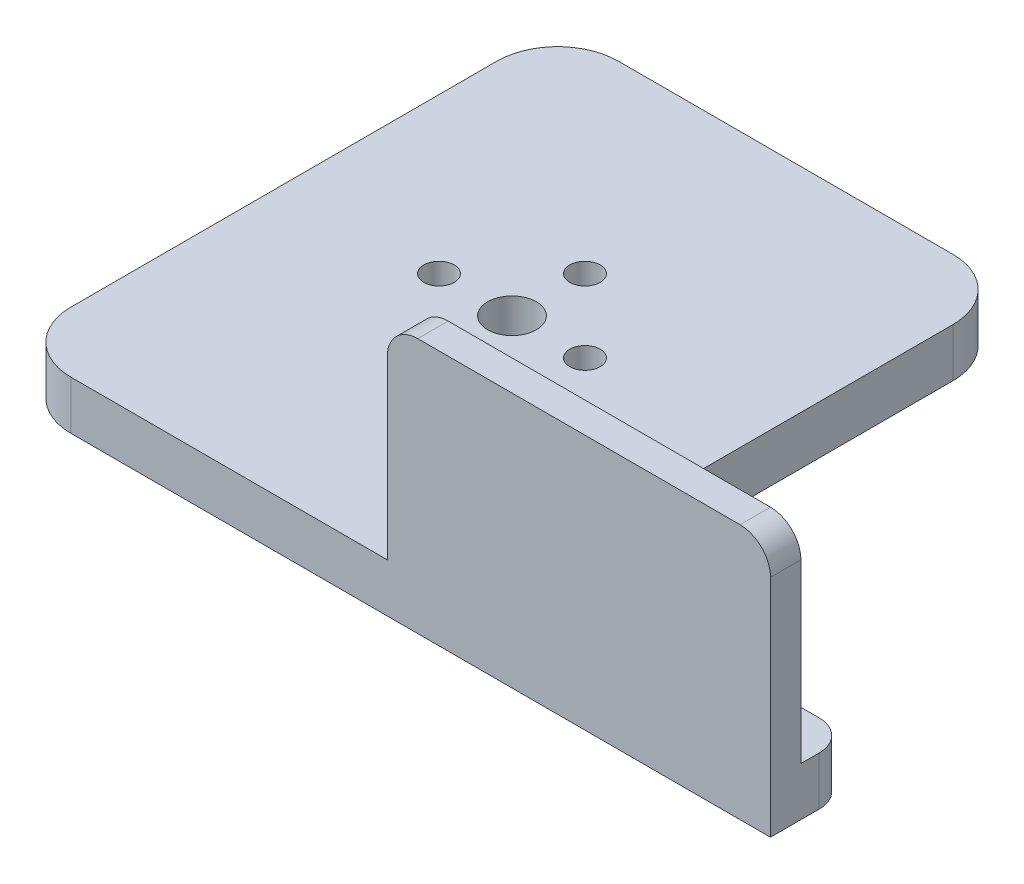
ISO-10303-21;
HEADER;
FILE_DESCRIPTION(('STEP AP214'),'2;1');
FILE_NAME('part.step','',(''),(''),'','','');
FILE_SCHEMA(('AUTOMOTIVE_DESIGN { 1 0 10303 214 1 1 1 1 }'));
ENDSEC;
DATA;
#1=APPLICATION_CONTEXT('core data for automotive mechanical design processes');
#2=APPLICATION_PROTOCOL_DEFINITION('international standard','automotive_design',2000,#1);
#3=PRODUCT_CONTEXT('',#1,'mechanical');
#4=PRODUCT('Part','Part','',(#3));
#5=PRODUCT_RELATED_PRODUCT_CATEGORY('part','',(#4));
#6=PRODUCT_DEFINITION_FORMATION('','',#4);
#7=PRODUCT_DEFINITION_CONTEXT('part definition',#1,'design');
#8=PRODUCT_DEFINITION('design','',#6,#7);
#9=PRODUCT_DEFINITION_SHAPE('','',#8);
#10=(LENGTH_UNIT() NAMED_UNIT(*) SI_UNIT(.MILLI.,.METRE.));
#11=(NAMED_UNIT(*) PLANE_ANGLE_UNIT() SI_UNIT($,.RADIAN.));
#12=(NAMED_UNIT(*) SI_UNIT($,.STERADIAN.) SOLID_ANGLE_UNIT());
#13=UNCERTAINTY_MEASURE_WITH_UNIT(LENGTH_MEASURE(1.E-05),#10,'distance_accuracy_value','');
#14=(GEOMETRIC_REPRESENTATION_CONTEXT(3) GLOBAL_UNCERTAINTY_ASSIGNED_CONTEXT((#13)) GLOBAL_UNIT_ASSIGNED_CONTEXT((#10,
#11,#12)) REPRESENTATION_CONTEXT('',''));
#15=CARTESIAN_POINT('',(0.,0.,0.));
#16=DIRECTION('',(0.,0.,1.));
#17=DIRECTION('',(1.,0.,0.));
#18=AXIS2_PLACEMENT_3D('',#15,#16,#17);
#19=CARTESIAN_POINT('',(67.,37.,90.));
#20=DIRECTION('',(0.,0.,1.));
#21=DIRECTION('',(1.,0.,0.));
#22=AXIS2_PLACEMENT_3D('',#19,#20,#21);
#23=CYLINDRICAL_SURFACE('',#22,5.);
#24=DIRECTION('',(0.,0.,1.));
#25=VECTOR('',#24,1.);
#26=CARTESIAN_POINT('',(67.,42.,90.));
#27=LINE('',#26,#25);
#28=CARTESIAN_POINT('',(67.,42.,85.));
#29=VERTEX_POINT('',#28);
#30=CARTESIAN_POINT('',(67.,42.,90.));
#31=VERTEX_POINT('',#30);
#32=EDGE_CURVE('E250',#29,#31,#27,.T.);
#33=ORIENTED_EDGE('',*,*,#32,.F.);
#34=CARTESIAN_POINT('',(67.,37.,85.));
#35=DIRECTION('',(0.,0.,-1.));
#36=DIRECTION('',(-1.,0.,0.));
#37=AXIS2_PLACEMENT_3D('',#34,#35,#36);
#38=CIRCLE('',#37,5.);
#39=CARTESIAN_POINT('',(62.,37.,85.));
#40=VERTEX_POINT('',#39);
#41=EDGE_CURVE('E48',#40,#29,#38,.T.);
#42=ORIENTED_EDGE('',*,*,#41,.F.);
#43=DIRECTION('',(0.,0.,1.));
#44=VECTOR('',#43,1.);
#45=CARTESIAN_POINT('',(62.,37.,0.));
#46=LINE('',#45,#44);
#47=CARTESIAN_POINT('',(62.,37.,90.));
#48=VERTEX_POINT('',#47);
#49=EDGE_CURVE('E253',#48,#40,#46,.F.);
#50=ORIENTED_EDGE('',*,*,#49,.F.);
#51=CARTESIAN_POINT('',(67.,37.,90.));
#52=DIRECTION('',(0.,0.,-1.));
#53=DIRECTION('',(-1.,0.,0.));
#54=AXIS2_PLACEMENT_3D('',#51,#52,#53);
#55=CIRCLE('',#54,5.);
#56=EDGE_CURVE('E11',#31,#48,#55,.F.);
#57=ORIENTED_EDGE('',*,*,#56,.F.);
#58=EDGE_LOOP('',(#33,#42,#50,#57));
#59=FACE_BOUND('',#58,.T.);
#60=ADVANCED_FACE('F41',(#59),#23,.T.);
#61=CARTESIAN_POINT('',(120.,8.,82.));
#62=DIRECTION('',(0.,-1.,0.));
#63=DIRECTION('',(0.,0.,-1.));
#64=AXIS2_PLACEMENT_3D('',#61,#62,#63);
#65=CYLINDRICAL_SURFACE('',#64,5.);
#66=DIRECTION('',(0.,1.,0.));
#67=VECTOR('',#66,1.);
#68=CARTESIAN_POINT('',(125.,8.,82.));
#69=LINE('',#68,#67);
#70=CARTESIAN_POINT('',(125.,0.,82.));
#71=VERTEX_POINT('',#70);
#72=CARTESIAN_POINT('',(125.,8.,82.));
#73=VERTEX_POINT('',#72);
#74=EDGE_CURVE('E240',#71,#73,#69,.T.);
#75=ORIENTED_EDGE('',*,*,#74,.F.);
#76=CARTESIAN_POINT('',(120.,0.,82.));
#77=DIRECTION('',(0.,1.,0.));
#78=DIRECTION('',(0.,0.,1.));
#79=AXIS2_PLACEMENT_3D('',#76,#77,#78);
#80=CIRCLE('',#79,5.);
#81=CARTESIAN_POINT('',(120.,0.,77.));
#82=VERTEX_POINT('',#81);
#83=EDGE_CURVE('E246',#82,#71,#80,.F.);
#84=ORIENTED_EDGE('',*,*,#83,.F.);
#85=DIRECTION('',(0.,1.,0.));
#86=VECTOR('',#85,1.);
#87=CARTESIAN_POINT('',(120.,8.,77.));
#88=LINE('',#87,#86);
#89=CARTESIAN_POINT('',(120.,8.,77.));
#90=VERTEX_POINT('',#89);
#91=EDGE_CURVE('E243',#90,#82,#88,.F.);
#92=ORIENTED_EDGE('',*,*,#91,.F.);
#93=CARTESIAN_POINT('',(120.,8.,82.));
#94=DIRECTION('',(0.,1.,0.));
#95=DIRECTION('',(0.,0.,1.));
#96=AXIS2_PLACEMENT_3D('',#93,#94,#95);
#97=CIRCLE('',#96,5.);
#98=EDGE_CURVE('E248',#73,#90,#97,.T.);
#99=ORIENTED_EDGE('',*,*,#98,.F.);
#100=EDGE_LOOP('',(#75,#84,#92,#99));
#101=FACE_BOUND('',#100,.T.);
#102=ADVANCED_FACE('F307',(#101),#65,.T.);
#103=CARTESIAN_POINT('',(120.,37.,0.));
#104=DIRECTION('',(0.,0.,-1.));
#105=DIRECTION('',(-1.,0.,0.));
#106=AXIS2_PLACEMENT_3D('',#103,#104,#105);
#107=CYLINDRICAL_SURFACE('',#106,5.);
#108=DIRECTION('',(0.,0.,1.));
#109=VECTOR('',#108,1.);
#110=CARTESIAN_POINT('',(125.,37.,0.));
#111=LINE('',#110,#109);
#112=CARTESIAN_POINT('',(125.,37.,85.));
#113=VERTEX_POINT('',#112);
#114=CARTESIAN_POINT('',(125.,37.,90.));
#115=VERTEX_POINT('',#114);
#116=EDGE_CURVE('E229',#113,#115,#111,.T.);
#117=ORIENTED_EDGE('',*,*,#116,.F.);
#118=CARTESIAN_POINT('',(120.,37.,85.));
#119=DIRECTION('',(0.,0.,-1.));
#120=DIRECTION('',(-1.,0.,0.));
#121=AXIS2_PLACEMENT_3D('',#118,#119,#120);
#122=CIRCLE('',#121,5.);
#123=CARTESIAN_POINT('',(120.,42.,85.));
#124=VERTEX_POINT('',#123);
#125=EDGE_CURVE('E235',#124,#113,#122,.T.);
#126=ORIENTED_EDGE('',*,*,#125,.F.);
#127=DIRECTION('',(0.,0.,1.));
#128=VECTOR('',#127,1.);
#129=CARTESIAN_POINT('',(120.,42.,0.));
#130=LINE('',#129,#128);
#131=CARTESIAN_POINT('',(120.,42.,90.));
#132=VERTEX_POINT('',#131);
#133=EDGE_CURVE('E232',#132,#124,#130,.F.);
#134=ORIENTED_EDGE('',*,*,#133,.F.);
#135=CARTESIAN_POINT('',(120.,37.,90.));
#136=DIRECTION('',(0.,0.,-1.));
#137=DIRECTION('',(-1.,0.,0.));
#138=AXIS2_PLACEMENT_3D('',#135,#136,#137);
#139=CIRCLE('',#138,5.);
#140=EDGE_CURVE('E237',#115,#132,#139,.F.);
#141=ORIENTED_EDGE('',*,*,#140,.F.);
#142=EDGE_LOOP('',(#117,#126,#134,#141));
#143=FACE_BOUND('',#142,.T.);
#144=ADVANCED_FACE('F303',(#143),#107,.T.);
#145=CARTESIAN_POINT('',(0.,8.,0.));
#146=DIRECTION('',(0.,1.,0.));
#147=DIRECTION('',(0.,0.,1.));
#148=AXIS2_PLACEMENT_3D('',#145,#146,#147);
#149=PLANE('',#148);
#150=CARTESIAN_POINT('',(37.5,8.,57.));
#151=DIRECTION('',(0.,1.,0.));
#152=DIRECTION('',(0.,0.,1.));
#153=AXIS2_PLACEMENT_3D('',#150,#151,#152);
#154=CIRCLE('',#153,2.5);
#155=CARTESIAN_POINT('',(37.5,8.,59.5));
#156=VERTEX_POINT('',#155);
#157=EDGE_CURVE('E548',#156,#156,#154,.F.);
#158=ORIENTED_EDGE('',*,*,#157,.T.);
#159=EDGE_LOOP('',(#158));
#160=FACE_BOUND('',#159,.T.);
#161=CARTESIAN_POINT('',(25.5000000000002,8.,45.));
#162=DIRECTION('',(0.,1.,0.));
#163=DIRECTION('',(0.,0.,1.));
#164=AXIS2_PLACEMENT_3D('',#161,#162,#163);
#165=CIRCLE('',#164,2.5);
#166=CARTESIAN_POINT('',(25.5000000000002,8.,47.5));
#167=VERTEX_POINT('',#166);
#168=EDGE_CURVE('E565',#167,#167,#165,.F.);
#169=ORIENTED_EDGE('',*,*,#168,.T.);
#170=EDGE_LOOP('',(#169));
#171=FACE_BOUND('',#170,.T.);
#172=CARTESIAN_POINT('',(37.5000000000003,8.,33.));
#173=DIRECTION('',(0.,1.,0.));
#174=DIRECTION('',(0.,0.,1.));
#175=AXIS2_PLACEMENT_3D('',#172,#173,#174);
#176=CIRCLE('',#175,2.50000000000001);
#177=CARTESIAN_POINT('',(37.5000000000003,8.,35.5));
#178=VERTEX_POINT('',#177);
#179=EDGE_CURVE('E571',#178,#178,#176,.F.);
#180=ORIENTED_EDGE('',*,*,#179,.T.);
#181=EDGE_LOOP('',(#180));
#182=FACE_BOUND('',#181,.T.);
#183=CARTESIAN_POINT('',(37.5,8.,45.));
#184=DIRECTION('',(0.,1.,0.));
#185=DIRECTION('',(0.,0.,1.));
#186=AXIS2_PLACEMENT_3D('',#183,#184,#185);
#187=CIRCLE('',#186,4.);
#188=CARTESIAN_POINT('',(37.5,8.,49.));
#189=VERTEX_POINT('',#188);
#190=EDGE_CURVE('E552',#189,#189,#187,.F.);
#191=ORIENTED_EDGE('',*,*,#190,.T.);
#192=EDGE_LOOP('',(#191));
#193=FACE_BOUND('',#192,.T.);
#194=CARTESIAN_POINT('',(49.5000000000002,8.,45.0000000000001));
#195=DIRECTION('',(0.,1.,0.));
#196=DIRECTION('',(0.,0.,1.));
#197=AXIS2_PLACEMENT_3D('',#194,#195,#196);
#198=CIRCLE('',#197,2.5);
#199=CARTESIAN_POINT('',(49.5000000000002,8.,47.5000000000001));
#200=VERTEX_POINT('',#199);
#201=EDGE_CURVE('E559',#200,#200,#198,.F.);
#202=ORIENTED_EDGE('',*,*,#201,.T.);
#203=EDGE_LOOP('',(#202));
#204=FACE_BOUND('',#203,.T.);
#205=DIRECTION('',(0.,0.,-1.));
#206=VECTOR('',#205,1.);
#207=CARTESIAN_POINT('',(125.,8.,0.));
#208=LINE('',#207,#206);
#209=CARTESIAN_POINT('',(125.,8.,85.));
#210=VERTEX_POINT('',#209);
#211=EDGE_CURVE('E166',#210,#73,#208,.T.);
#212=ORIENTED_EDGE('',*,*,#211,.T.);
#213=ORIENTED_EDGE('',*,*,#98,.T.);
#214=DIRECTION('',(1.,0.,0.));
#215=VECTOR('',#214,1.);
#216=CARTESIAN_POINT('',(0.,8.,77.));
#217=LINE('',#216,#215);
#218=CARTESIAN_POINT('',(75.,8.,77.));
#219=VERTEX_POINT('',#218);
#220=EDGE_CURVE('E169',#219,#90,#217,.T.);
#221=ORIENTED_EDGE('',*,*,#220,.F.);
#222=DIRECTION('',(0.,0.,1.));
#223=VECTOR('',#222,1.);
#224=CARTESIAN_POINT('',(75.,8.,0.));
#225=LINE('',#224,#223);
#226=CARTESIAN_POINT('',(75.,8.,10.));
#227=VERTEX_POINT('',#226);
#228=EDGE_CURVE('E196',#227,#219,#225,.T.);
#229=ORIENTED_EDGE('',*,*,#228,.F.);
#230=CARTESIAN_POINT('',(65.,8.,10.));
#231=DIRECTION('',(0.,1.,0.));
#232=DIRECTION('',(0.,0.,1.));
#233=AXIS2_PLACEMENT_3D('',#230,#231,#232);
#234=CIRCLE('',#233,10.);
#235=CARTESIAN_POINT('',(65.,8.,0.));
#236=VERTEX_POINT('',#235);
#237=EDGE_CURVE('E225',#227,#236,#234,.T.);
#238=ORIENTED_EDGE('',*,*,#237,.T.);
#239=DIRECTION('',(1.,0.,0.));
#240=VECTOR('',#239,1.);
#241=CARTESIAN_POINT('',(0.,8.,0.));
#242=LINE('',#241,#240);
#243=CARTESIAN_POINT('',(10.,8.,0.));
#244=VERTEX_POINT('',#243);
#245=EDGE_CURVE('E171',#244,#236,#242,.T.);
#246=ORIENTED_EDGE('',*,*,#245,.F.);
#247=CARTESIAN_POINT('',(10.,8.,10.));
#248=DIRECTION('',(0.,1.,0.));
#249=DIRECTION('',(0.,0.,1.));
#250=AXIS2_PLACEMENT_3D('',#247,#248,#249);
#251=CIRCLE('',#250,10.);
#252=CARTESIAN_POINT('',(0.,8.,10.));
#253=VERTEX_POINT('',#252);
#254=EDGE_CURVE('E209',#244,#253,#251,.T.);
#255=ORIENTED_EDGE('',*,*,#254,.T.);
#256=DIRECTION('',(0.,0.,1.));
#257=VECTOR('',#256,1.);
#258=CARTESIAN_POINT('',(0.,8.,0.));
#259=LINE('',#258,#257);
#260=CARTESIAN_POINT('',(0.,8.,80.));
#261=VERTEX_POINT('',#260);
#262=EDGE_CURVE('E167',#253,#261,#259,.T.);
#263=ORIENTED_EDGE('',*,*,#262,.T.);
#264=CARTESIAN_POINT('',(10.,8.,80.));
#265=DIRECTION('',(0.,1.,0.));
#266=DIRECTION('',(0.,0.,1.));
#267=AXIS2_PLACEMENT_3D('',#264,#265,#266);
#268=CIRCLE('',#267,10.);
#269=CARTESIAN_POINT('',(10.,8.,90.));
#270=VERTEX_POINT('',#269);
#271=EDGE_CURVE('E164',#261,#270,#268,.T.);
#272=ORIENTED_EDGE('',*,*,#271,.T.);
#273=DIRECTION('',(1.,0.,0.));
#274=VECTOR('',#273,1.);
#275=CARTESIAN_POINT('',(0.,8.,90.));
#276=LINE('',#275,#274);
#277=CARTESIAN_POINT('',(62.,8.,90.));
#278=VERTEX_POINT('',#277);
#279=EDGE_CURVE('E148',#270,#278,#276,.T.);
#280=ORIENTED_EDGE('',*,*,#279,.T.);
#281=DIRECTION('',(0.,0.,-1.));
#282=VECTOR('',#281,1.);
#283=CARTESIAN_POINT('',(62.,8.,90.));
#284=LINE('',#283,#282);
#285=CARTESIAN_POINT('',(62.,8.,85.));
#286=VERTEX_POINT('',#285);
#287=EDGE_CURVE('E150',#278,#286,#284,.T.);
#288=ORIENTED_EDGE('',*,*,#287,.T.);
#289=DIRECTION('',(1.,0.,0.));
#290=VECTOR('',#289,1.);
#291=CARTESIAN_POINT('',(62.,8.,85.));
#292=LINE('',#291,#290);
#293=EDGE_CURVE('E262',#286,#210,#292,.T.);
#294=ORIENTED_EDGE('',*,*,#293,.T.);
#295=EDGE_LOOP('',(#212,#213,#221,#229,#238,#246,#255,#263,#272,#280,#288,#294));
#296=FACE_BOUND('',#295,.T.);
#297=ADVANCED_FACE('F162',(#160,#171,#182,#193,#204,#296),#149,.T.);
#298=CARTESIAN_POINT('',(65.,8.,10.));
#299=DIRECTION('',(0.,-1.,0.));
#300=DIRECTION('',(0.,0.,-1.));
#301=AXIS2_PLACEMENT_3D('',#298,#299,#300);
#302=CYLINDRICAL_SURFACE('',#301,10.);
#303=DIRECTION('',(0.,-1.,0.));
#304=VECTOR('',#303,1.);
#305=CARTESIAN_POINT('',(65.,8.,0.));
#306=LINE('',#305,#304);
#307=CARTESIAN_POINT('',(65.,0.,0.));
#308=VERTEX_POINT('',#307);
#309=EDGE_CURVE('E219',#236,#308,#306,.T.);
#310=ORIENTED_EDGE('',*,*,#309,.F.);
#311=ORIENTED_EDGE('',*,*,#237,.F.);
#312=DIRECTION('',(0.,-1.,0.));
#313=VECTOR('',#312,1.);
#314=CARTESIAN_POINT('',(75.,8.,10.));
#315=LINE('',#314,#313);
#316=CARTESIAN_POINT('',(75.,0.,10.));
#317=VERTEX_POINT('',#316);
#318=EDGE_CURVE('E222',#317,#227,#315,.F.);
#319=ORIENTED_EDGE('',*,*,#318,.F.);
#320=CARTESIAN_POINT('',(65.,0.,10.));
#321=DIRECTION('',(0.,1.,0.));
#322=DIRECTION('',(0.,0.,1.));
#323=AXIS2_PLACEMENT_3D('',#320,#321,#322);
#324=CIRCLE('',#323,10.);
#325=EDGE_CURVE('E227',#308,#317,#324,.F.);
#326=ORIENTED_EDGE('',*,*,#325,.F.);
#327=EDGE_LOOP('',(#310,#311,#319,#326));
#328=FACE_BOUND('',#327,.T.);
#329=ADVANCED_FACE('F280',(#328),#302,.T.);
#330=CARTESIAN_POINT('',(10.,8.,80.));
#331=DIRECTION('',(0.,-1.,0.));
#332=DIRECTION('',(0.,0.,-1.));
#333=AXIS2_PLACEMENT_3D('',#330,#331,#332);
#334=CYLINDRICAL_SURFACE('',#333,10.);
#335=DIRECTION('',(0.,-1.,0.));
#336=VECTOR('',#335,1.);
#337=CARTESIAN_POINT('',(10.,8.,90.));
#338=LINE('',#337,#336);
#339=CARTESIAN_POINT('',(10.,0.,90.));
#340=VERTEX_POINT('',#339);
#341=EDGE_CURVE('E211',#270,#340,#338,.T.);
#342=ORIENTED_EDGE('',*,*,#341,.F.);
#343=ORIENTED_EDGE('',*,*,#271,.F.);
#344=DIRECTION('',(0.,-1.,0.));
#345=VECTOR('',#344,1.);
#346=CARTESIAN_POINT('',(0.,8.,80.));
#347=LINE('',#346,#345);
#348=CARTESIAN_POINT('',(0.,0.,80.));
#349=VERTEX_POINT('',#348);
#350=EDGE_CURVE('E213',#349,#261,#347,.F.);
#351=ORIENTED_EDGE('',*,*,#350,.F.);
#352=CARTESIAN_POINT('',(10.,0.,80.));
#353=DIRECTION('',(0.,1.,0.));
#354=DIRECTION('',(0.,0.,1.));
#355=AXIS2_PLACEMENT_3D('',#352,#353,#354);
#356=CIRCLE('',#355,10.);
#357=EDGE_CURVE('E217',#340,#349,#356,.F.);
#358=ORIENTED_EDGE('',*,*,#357,.F.);
#359=EDGE_LOOP('',(#342,#343,#351,#358));
#360=FACE_BOUND('',#359,.T.);
#361=ADVANCED_FACE('F292',(#360),#334,.T.);
#362=CARTESIAN_POINT('',(10.,8.,10.));
#363=DIRECTION('',(0.,-1.,0.));
#364=DIRECTION('',(0.,0.,-1.));
#365=AXIS2_PLACEMENT_3D('',#362,#363,#364);
#366=CYLINDRICAL_SURFACE('',#365,10.);
#367=DIRECTION('',(0.,1.,0.));
#368=VECTOR('',#367,1.);
#369=CARTESIAN_POINT('',(10.,8.,0.));
#370=LINE('',#369,#368);
#371=CARTESIAN_POINT('',(10.,0.,0.));
#372=VERTEX_POINT('',#371);
#373=EDGE_CURVE('E201',#372,#244,#370,.T.);
#374=ORIENTED_EDGE('',*,*,#373,.F.);
#375=CARTESIAN_POINT('',(10.,0.,10.));
#376=DIRECTION('',(0.,1.,0.));
#377=DIRECTION('',(0.,0.,1.));
#378=AXIS2_PLACEMENT_3D('',#375,#376,#377);
#379=CIRCLE('',#378,10.);
#380=CARTESIAN_POINT('',(0.,0.,10.));
#381=VERTEX_POINT('',#380);
#382=EDGE_CURVE('E207',#381,#372,#379,.F.);
#383=ORIENTED_EDGE('',*,*,#382,.F.);
#384=DIRECTION('',(0.,1.,0.));
#385=VECTOR('',#384,1.);
#386=CARTESIAN_POINT('',(0.,8.,10.));
#387=LINE('',#386,#385);
#388=EDGE_CURVE('E204',#253,#381,#387,.F.);
#389=ORIENTED_EDGE('',*,*,#388,.F.);
#390=ORIENTED_EDGE('',*,*,#254,.F.);
#391=EDGE_LOOP('',(#374,#383,#389,#390));
#392=FACE_BOUND('',#391,.T.);
#393=ADVANCED_FACE('F286',(#392),#366,.T.);
#394=CARTESIAN_POINT('',(75.,8.,0.));
#395=DIRECTION('',(1.,0.,0.));
#396=DIRECTION('',(0.,0.,-1.));
#397=AXIS2_PLACEMENT_3D('',#394,#395,#396);
#398=PLANE('',#397);
#399=DIRECTION('',(0.,0.,1.));
#400=VECTOR('',#399,1.);
#401=CARTESIAN_POINT('',(75.,0.,0.));
#402=LINE('',#401,#400);
#403=CARTESIAN_POINT('',(75.,0.,77.));
#404=VERTEX_POINT('',#403);
#405=EDGE_CURVE('E178',#317,#404,#402,.T.);
#406=ORIENTED_EDGE('',*,*,#405,.F.);
#407=ORIENTED_EDGE('',*,*,#318,.T.);
#408=ORIENTED_EDGE('',*,*,#228,.T.);
#409=DIRECTION('',(0.,-1.,0.));
#410=VECTOR('',#409,1.);
#411=CARTESIAN_POINT('',(75.,8.,77.));
#412=LINE('',#411,#410);
#413=EDGE_CURVE('E177',#219,#404,#412,.T.);
#414=ORIENTED_EDGE('',*,*,#413,.T.);
#415=EDGE_LOOP('',(#406,#407,#408,#414));
#416=FACE_BOUND('',#415,.T.);
#417=ADVANCED_FACE('F313',(#416),#398,.T.);
#418=CARTESIAN_POINT('',(0.,8.,0.));
#419=DIRECTION('',(0.,0.,-1.));
#420=DIRECTION('',(-1.,0.,0.));
#421=AXIS2_PLACEMENT_3D('',#418,#419,#420);
#422=PLANE('',#421);
#423=ORIENTED_EDGE('',*,*,#245,.T.);
#424=ORIENTED_EDGE('',*,*,#309,.T.);
#425=DIRECTION('',(1.,0.,0.));
#426=VECTOR('',#425,1.);
#427=CARTESIAN_POINT('',(0.,0.,0.));
#428=LINE('',#427,#426);
#429=EDGE_CURVE('E180',#372,#308,#428,.T.);
#430=ORIENTED_EDGE('',*,*,#429,.F.);
#431=ORIENTED_EDGE('',*,*,#373,.T.);
#432=EDGE_LOOP('',(#423,#424,#430,#431));
#433=FACE_BOUND('',#432,.T.);
#434=ADVANCED_FACE('F271',(#433),#422,.T.);
#435=CARTESIAN_POINT('',(0.,8.,0.));
#436=DIRECTION('',(1.,0.,0.));
#437=DIRECTION('',(0.,0.,-1.));
#438=AXIS2_PLACEMENT_3D('',#435,#436,#437);
#439=PLANE('',#438);
#440=DIRECTION('',(0.,0.,1.));
#441=VECTOR('',#440,1.);
#442=CARTESIAN_POINT('',(0.,0.,0.));
#443=LINE('',#442,#441);
#444=EDGE_CURVE('E184',#381,#349,#443,.T.);
#445=ORIENTED_EDGE('',*,*,#444,.T.);
#446=ORIENTED_EDGE('',*,*,#350,.T.);
#447=ORIENTED_EDGE('',*,*,#262,.F.);
#448=ORIENTED_EDGE('',*,*,#388,.T.);
#449=EDGE_LOOP('',(#445,#446,#447,#448));
#450=FACE_BOUND('',#449,.T.);
#451=ADVANCED_FACE('F289',(#450),#439,.F.);
#452=CARTESIAN_POINT('',(0.,8.,90.));
#453=DIRECTION('',(0.,0.,-1.));
#454=DIRECTION('',(-1.,0.,0.));
#455=AXIS2_PLACEMENT_3D('',#452,#453,#454);
#456=PLANE('',#455);
#457=DIRECTION('',(1.,0.,0.));
#458=VECTOR('',#457,1.);
#459=CARTESIAN_POINT('',(62.,42.,90.));
#460=LINE('',#459,#458);
#461=EDGE_CURVE('E181',#31,#132,#460,.T.);
#462=ORIENTED_EDGE('',*,*,#461,.F.);
#463=ORIENTED_EDGE('',*,*,#56,.T.);
#464=DIRECTION('',(0.,-1.,0.));
#465=VECTOR('',#464,1.);
#466=CARTESIAN_POINT('',(62.,8.,90.));
#467=LINE('',#466,#465);
#468=EDGE_CURVE('E143',#48,#278,#467,.T.);
#469=ORIENTED_EDGE('',*,*,#468,.T.);
#470=ORIENTED_EDGE('',*,*,#279,.F.);
#471=ORIENTED_EDGE('',*,*,#341,.T.);
#472=DIRECTION('',(1.,0.,0.));
#473=VECTOR('',#472,1.);
#474=CARTESIAN_POINT('',(0.,0.,90.));
#475=LINE('',#474,#473);
#476=CARTESIAN_POINT('',(125.,0.,90.));
#477=VERTEX_POINT('',#476);
#478=EDGE_CURVE('E187',#340,#477,#475,.T.);
#479=ORIENTED_EDGE('',*,*,#478,.T.);
#480=DIRECTION('',(0.,-1.,0.));
#481=VECTOR('',#480,1.);
#482=CARTESIAN_POINT('',(125.,8.,90.));
#483=LINE('',#482,#481);
#484=EDGE_CURVE('E199',#115,#477,#483,.T.);
#485=ORIENTED_EDGE('',*,*,#484,.F.);
#486=ORIENTED_EDGE('',*,*,#140,.T.);
#487=EDGE_LOOP('',(#462,#463,#469,#470,#471,#479,#485,#486));
#488=FACE_BOUND('',#487,.T.);
#489=ADVANCED_FACE('F145',(#488),#456,.F.);
#490=CARTESIAN_POINT('',(125.,8.,0.));
#491=DIRECTION('',(-1.,0.,0.));
#492=DIRECTION('',(0.,0.,1.));
#493=AXIS2_PLACEMENT_3D('',#490,#491,#492);
#494=PLANE('',#493);
#495=DIRECTION('',(0.,0.,-1.));
#496=VECTOR('',#495,1.);
#497=CARTESIAN_POINT('',(125.,0.,0.));
#498=LINE('',#497,#496);
#499=EDGE_CURVE('E190',#477,#71,#498,.T.);
#500=ORIENTED_EDGE('',*,*,#499,.T.);
#501=ORIENTED_EDGE('',*,*,#74,.T.);
#502=ORIENTED_EDGE('',*,*,#211,.F.);
#503=DIRECTION('',(0.,1.,0.));
#504=VECTOR('',#503,1.);
#505=CARTESIAN_POINT('',(125.,8.,85.));
#506=LINE('',#505,#504);
#507=EDGE_CURVE('E151',#210,#113,#506,.T.);
#508=ORIENTED_EDGE('',*,*,#507,.T.);
#509=ORIENTED_EDGE('',*,*,#116,.T.);
#510=ORIENTED_EDGE('',*,*,#484,.T.);
#511=EDGE_LOOP('',(#500,#501,#502,#508,#509,#510));
#512=FACE_BOUND('',#511,.T.);
#513=ADVANCED_FACE('F298',(#512),#494,.F.);
#514=CARTESIAN_POINT('',(0.,8.,77.));
#515=DIRECTION('',(0.,0.,-1.));
#516=DIRECTION('',(-1.,0.,0.));
#517=AXIS2_PLACEMENT_3D('',#514,#515,#516);
#518=PLANE('',#517);
#519=ORIENTED_EDGE('',*,*,#220,.T.);
#520=ORIENTED_EDGE('',*,*,#91,.T.);
#521=DIRECTION('',(1.,0.,0.));
#522=VECTOR('',#521,1.);
#523=CARTESIAN_POINT('',(0.,0.,77.));
#524=LINE('',#523,#522);
#525=EDGE_CURVE('E193',#404,#82,#524,.T.);
#526=ORIENTED_EDGE('',*,*,#525,.F.);
#527=ORIENTED_EDGE('',*,*,#413,.F.);
#528=EDGE_LOOP('',(#519,#520,#526,#527));
#529=FACE_BOUND('',#528,.T.);
#530=ADVANCED_FACE('F311',(#529),#518,.T.);
#531=CARTESIAN_POINT('',(0.,0.,0.));
#532=DIRECTION('',(0.,1.,0.));
#533=DIRECTION('',(0.,0.,1.));
#534=AXIS2_PLACEMENT_3D('',#531,#532,#533);
#535=PLANE('',#534);
#536=CARTESIAN_POINT('',(37.5,0.,45.));
#537=DIRECTION('',(0.,-1.,0.));
#538=DIRECTION('',(0.,0.,-1.));
#539=AXIS2_PLACEMENT_3D('',#536,#537,#538);
#540=CIRCLE('',#539,16.);
#541=CARTESIAN_POINT('',(37.5,0.,29.));
#542=VERTEX_POINT('',#541);
#543=EDGE_CURVE('E541',#542,#542,#540,.T.);
#544=ORIENTED_EDGE('',*,*,#543,.F.);
#545=EDGE_LOOP('',(#544));
#546=FACE_BOUND('',#545,.T.);
#547=ORIENTED_EDGE('',*,*,#525,.T.);
#548=ORIENTED_EDGE('',*,*,#83,.T.);
#549=ORIENTED_EDGE('',*,*,#499,.F.);
#550=ORIENTED_EDGE('',*,*,#478,.F.);
#551=ORIENTED_EDGE('',*,*,#357,.T.);
#552=ORIENTED_EDGE('',*,*,#444,.F.);
#553=ORIENTED_EDGE('',*,*,#382,.T.);
#554=ORIENTED_EDGE('',*,*,#429,.T.);
#555=ORIENTED_EDGE('',*,*,#325,.T.);
#556=ORIENTED_EDGE('',*,*,#405,.T.);
#557=EDGE_LOOP('',(#547,#548,#549,#550,#551,#552,#553,#554,#555,#556));
#558=FACE_BOUND('',#557,.T.);
#559=ADVANCED_FACE('F283',(#546,#558),#535,.F.);
#560=CARTESIAN_POINT('',(62.,42.,90.));
#561=DIRECTION('',(0.,1.,0.));
#562=DIRECTION('',(0.,0.,1.));
#563=AXIS2_PLACEMENT_3D('',#560,#561,#562);
#564=PLANE('',#563);
#565=DIRECTION('',(1.,0.,0.));
#566=VECTOR('',#565,1.);
#567=CARTESIAN_POINT('',(62.,42.,85.));
#568=LINE('',#567,#566);
#569=EDGE_CURVE('E257',#29,#124,#568,.T.);
#570=ORIENTED_EDGE('',*,*,#569,.F.);
#571=ORIENTED_EDGE('',*,*,#32,.T.);
#572=ORIENTED_EDGE('',*,*,#461,.T.);
#573=ORIENTED_EDGE('',*,*,#133,.T.);
#574=EDGE_LOOP('',(#570,#571,#572,#573));
#575=FACE_BOUND('',#574,.T.);
#576=ADVANCED_FACE('F260',(#575),#564,.T.);
#577=CARTESIAN_POINT('',(62.,8.,85.));
#578=DIRECTION('',(0.,0.,-1.));
#579=DIRECTION('',(-1.,0.,0.));
#580=AXIS2_PLACEMENT_3D('',#577,#578,#579);
#581=PLANE('',#580);
#582=DIRECTION('',(0.,1.,0.));
#583=VECTOR('',#582,1.);
#584=CARTESIAN_POINT('',(62.,8.,85.));
#585=LINE('',#584,#583);
#586=EDGE_CURVE('E157',#286,#40,#585,.T.);
#587=ORIENTED_EDGE('',*,*,#586,.T.);
#588=ORIENTED_EDGE('',*,*,#41,.T.);
#589=ORIENTED_EDGE('',*,*,#569,.T.);
#590=ORIENTED_EDGE('',*,*,#125,.T.);
#591=ORIENTED_EDGE('',*,*,#507,.F.);
#592=ORIENTED_EDGE('',*,*,#293,.F.);
#593=EDGE_LOOP('',(#587,#588,#589,#590,#591,#592));
#594=FACE_BOUND('',#593,.T.);
#595=ADVANCED_FACE('F255',(#594),#581,.T.);
#596=CARTESIAN_POINT('',(62.,0.,0.));
#597=DIRECTION('',(-1.,0.,0.));
#598=DIRECTION('',(0.,0.,1.));
#599=AXIS2_PLACEMENT_3D('',#596,#597,#598);
#600=PLANE('',#599);
#601=ORIENTED_EDGE('',*,*,#468,.F.);
#602=ORIENTED_EDGE('',*,*,#49,.T.);
#603=ORIENTED_EDGE('',*,*,#586,.F.);
#604=ORIENTED_EDGE('',*,*,#287,.F.);
#605=EDGE_LOOP('',(#601,#602,#603,#604));
#606=FACE_BOUND('',#605,.T.);
#607=ADVANCED_FACE('F155',(#606),#600,.T.);
#608=CARTESIAN_POINT('',(37.5,1.,45.));
#609=DIRECTION('',(0.,-1.,0.));
#610=DIRECTION('',(0.,0.,-1.));
#611=AXIS2_PLACEMENT_3D('',#608,#609,#610);
#612=CYLINDRICAL_SURFACE('',#611,16.);
#613=CARTESIAN_POINT('',(37.5,1.,45.));
#614=DIRECTION('',(0.,-1.,0.));
#615=DIRECTION('',(0.,0.,-1.));
#616=AXIS2_PLACEMENT_3D('',#613,#614,#615);
#617=CIRCLE('',#616,16.);
#618=CARTESIAN_POINT('',(37.5,1.,29.));
#619=VERTEX_POINT('',#618);
#620=EDGE_CURVE('E304',#619,#619,#617,.T.);
#621=ORIENTED_EDGE('',*,*,#620,.F.);
#622=EDGE_LOOP('',(#621));
#623=FACE_BOUND('',#622,.T.);
#624=ORIENTED_EDGE('',*,*,#543,.T.);
#625=EDGE_LOOP('',(#624));
#626=FACE_BOUND('',#625,.T.);
#627=ADVANCED_FACE('F410',(#623,#626),#612,.F.);
#628=CARTESIAN_POINT('',(37.5,1.,45.));
#629=DIRECTION('',(0.,-1.,0.));
#630=DIRECTION('',(0.,0.,-1.));
#631=AXIS2_PLACEMENT_3D('',#628,#629,#630);
#632=PLANE('',#631);
#633=CARTESIAN_POINT('',(37.5,1.,45.));
#634=DIRECTION('',(0.,-1.,0.));
#635=DIRECTION('',(0.,0.,-1.));
#636=AXIS2_PLACEMENT_3D('',#633,#634,#635);
#637=CIRCLE('',#636,4.);
#638=CARTESIAN_POINT('',(37.5,1.,41.));
#639=VERTEX_POINT('',#638);
#640=EDGE_CURVE('E555',#639,#639,#637,.T.);
#641=ORIENTED_EDGE('',*,*,#640,.F.);
#642=EDGE_LOOP('',(#641));
#643=FACE_BOUND('',#642,.T.);
#644=CARTESIAN_POINT('',(37.5,1.,57.));
#645=DIRECTION('',(0.,-1.,0.));
#646=DIRECTION('',(0.,0.,-1.));
#647=AXIS2_PLACEMENT_3D('',#644,#645,#646);
#648=CIRCLE('',#647,2.5);
#649=CARTESIAN_POINT('',(37.5,1.,54.5));
#650=VERTEX_POINT('',#649);
#651=EDGE_CURVE('E543',#650,#650,#648,.T.);
#652=ORIENTED_EDGE('',*,*,#651,.F.);
#653=EDGE_LOOP('',(#652));
#654=FACE_BOUND('',#653,.T.);
#655=CARTESIAN_POINT('',(25.5000000000002,1.,45.));
#656=DIRECTION('',(0.,-1.,0.));
#657=DIRECTION('',(0.,0.,-1.));
#658=AXIS2_PLACEMENT_3D('',#655,#656,#657);
#659=CIRCLE('',#658,2.5);
#660=CARTESIAN_POINT('',(25.5000000000002,1.,42.5));
#661=VERTEX_POINT('',#660);
#662=EDGE_CURVE('E568',#661,#661,#659,.T.);
#663=ORIENTED_EDGE('',*,*,#662,.F.);
#664=EDGE_LOOP('',(#663));
#665=FACE_BOUND('',#664,.T.);
#666=CARTESIAN_POINT('',(37.5000000000003,1.,33.));
#667=DIRECTION('',(0.,-1.,0.));
#668=DIRECTION('',(0.,0.,-1.));
#669=AXIS2_PLACEMENT_3D('',#666,#667,#668);
#670=CIRCLE('',#669,2.50000000000001);
#671=CARTESIAN_POINT('',(37.5000000000003,1.,30.5));
#672=VERTEX_POINT('',#671);
#673=EDGE_CURVE('E556',#672,#672,#670,.T.);
#674=ORIENTED_EDGE('',*,*,#673,.F.);
#675=EDGE_LOOP('',(#674));
#676=FACE_BOUND('',#675,.T.);
#677=CARTESIAN_POINT('',(49.5000000000002,1.,45.0000000000001));
#678=DIRECTION('',(0.,-1.,0.));
#679=DIRECTION('',(0.,0.,-1.));
#680=AXIS2_PLACEMENT_3D('',#677,#678,#679);
#681=CIRCLE('',#680,2.5);
#682=CARTESIAN_POINT('',(49.5000000000002,1.,42.5000000000001));
#683=VERTEX_POINT('',#682);
#684=EDGE_CURVE('E562',#683,#683,#681,.T.);
#685=ORIENTED_EDGE('',*,*,#684,.F.);
#686=EDGE_LOOP('',(#685));
#687=FACE_BOUND('',#686,.T.);
#688=ORIENTED_EDGE('',*,*,#620,.T.);
#689=EDGE_LOOP('',(#688));
#690=FACE_BOUND('',#689,.T.);
#691=ADVANCED_FACE('F434',(#643,#654,#665,#676,#687,#690),#632,.T.);
#692=CARTESIAN_POINT('',(49.5000000000002,42.001,45.0000000000001));
#693=DIRECTION('',(0.,-1.,0.));
#694=DIRECTION('',(0.,0.,-1.));
#695=AXIS2_PLACEMENT_3D('',#692,#693,#694);
#696=CYLINDRICAL_SURFACE('',#695,2.5);
#697=ORIENTED_EDGE('',*,*,#201,.F.);
#698=EDGE_LOOP('',(#697));
#699=FACE_BOUND('',#698,.T.);
#700=ORIENTED_EDGE('',*,*,#684,.T.);
#701=EDGE_LOOP('',(#700));
#702=FACE_BOUND('',#701,.T.);
#703=ADVANCED_FACE('F444',(#699,#702),#696,.F.);
#704=CARTESIAN_POINT('',(37.5000000000003,42.001,33.));
#705=DIRECTION('',(0.,-1.,0.));
#706=DIRECTION('',(0.,0.,-1.));
#707=AXIS2_PLACEMENT_3D('',#704,#705,#706);
#708=CYLINDRICAL_SURFACE('',#707,2.50000000000001);
#709=ORIENTED_EDGE('',*,*,#179,.F.);
#710=EDGE_LOOP('',(#709));
#711=FACE_BOUND('',#710,.T.);
#712=ORIENTED_EDGE('',*,*,#673,.T.);
#713=EDGE_LOOP('',(#712));
#714=FACE_BOUND('',#713,.T.);
#715=ADVANCED_FACE('F454',(#711,#714),#708,.F.);
#716=CARTESIAN_POINT('',(25.5000000000002,42.001,45.));
#717=DIRECTION('',(0.,-1.,0.));
#718=DIRECTION('',(0.,0.,-1.));
#719=AXIS2_PLACEMENT_3D('',#716,#717,#718);
#720=CYLINDRICAL_SURFACE('',#719,2.5);
#721=ORIENTED_EDGE('',*,*,#168,.F.);
#722=EDGE_LOOP('',(#721));
#723=FACE_BOUND('',#722,.T.);
#724=ORIENTED_EDGE('',*,*,#662,.T.);
#725=EDGE_LOOP('',(#724));
#726=FACE_BOUND('',#725,.T.);
#727=ADVANCED_FACE('F464',(#723,#726),#720,.F.);
#728=CARTESIAN_POINT('',(37.5,42.001,57.));
#729=DIRECTION('',(0.,-1.,0.));
#730=DIRECTION('',(0.,0.,-1.));
#731=AXIS2_PLACEMENT_3D('',#728,#729,#730);
#732=CYLINDRICAL_SURFACE('',#731,2.5);
#733=ORIENTED_EDGE('',*,*,#157,.F.);
#734=EDGE_LOOP('',(#733));
#735=FACE_BOUND('',#734,.T.);
#736=ORIENTED_EDGE('',*,*,#651,.T.);
#737=EDGE_LOOP('',(#736));
#738=FACE_BOUND('',#737,.T.);
#739=ADVANCED_FACE('F474',(#735,#738),#732,.F.);
#740=CARTESIAN_POINT('',(37.5,42.001,45.));
#741=DIRECTION('',(0.,-1.,0.));
#742=DIRECTION('',(0.,0.,-1.));
#743=AXIS2_PLACEMENT_3D('',#740,#741,#742);
#744=CYLINDRICAL_SURFACE('',#743,4.);
#745=ORIENTED_EDGE('',*,*,#190,.F.);
#746=EDGE_LOOP('',(#745));
#747=FACE_BOUND('',#746,.T.);
#748=ORIENTED_EDGE('',*,*,#640,.T.);
#749=EDGE_LOOP('',(#748));
#750=FACE_BOUND('',#749,.T.);
#751=ADVANCED_FACE('F484',(#747,#750),#744,.F.);
#752=CLOSED_SHELL('',(#60,#102,#144,#297,#329,#361,#393,#417,#434,#451,#489,#513,#530,#559,#576,
#595,#607,#627,#691,#703,#715,#727,#739,#751));
#753=MANIFOLD_SOLID_BREP('B2',#752);
#754=ADVANCED_BREP_SHAPE_REPRESENTATION('',(#18,#753),#14);
#755=SHAPE_DEFINITION_REPRESENTATION(#9,#754);
ENDSEC;
END-ISO-10303-21;
